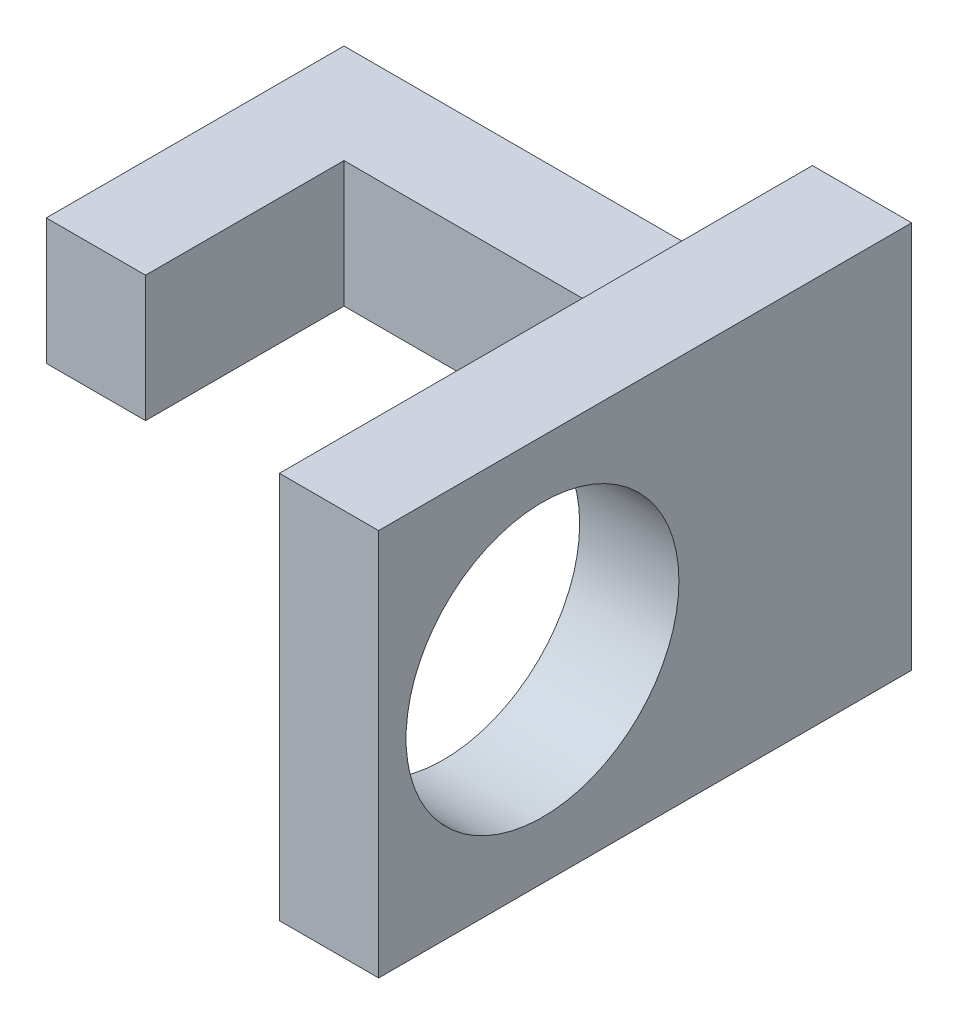
ISO-10303-21;
HEADER;
FILE_DESCRIPTION(('STEP AP214'),'2;1');
FILE_NAME('part.step','',(''),(''),'','','');
FILE_SCHEMA(('AUTOMOTIVE_DESIGN { 1 0 10303 214 1 1 1 1 }'));
ENDSEC;
DATA;
#1=APPLICATION_CONTEXT('core data for automotive mechanical design processes');
#2=APPLICATION_PROTOCOL_DEFINITION('international standard','automotive_design',2000,#1);
#3=PRODUCT_CONTEXT('',#1,'mechanical');
#4=PRODUCT('Part','Part','',(#3));
#5=PRODUCT_RELATED_PRODUCT_CATEGORY('part','',(#4));
#6=PRODUCT_DEFINITION_FORMATION('','',#4);
#7=PRODUCT_DEFINITION_CONTEXT('part definition',#1,'design');
#8=PRODUCT_DEFINITION('design','',#6,#7);
#9=PRODUCT_DEFINITION_SHAPE('','',#8);
#10=(LENGTH_UNIT() NAMED_UNIT(*) SI_UNIT(.MILLI.,.METRE.));
#11=(NAMED_UNIT(*) PLANE_ANGLE_UNIT() SI_UNIT($,.RADIAN.));
#12=(NAMED_UNIT(*) SI_UNIT($,.STERADIAN.) SOLID_ANGLE_UNIT());
#13=UNCERTAINTY_MEASURE_WITH_UNIT(LENGTH_MEASURE(1.E-05),#10,'distance_accuracy_value','');
#14=(GEOMETRIC_REPRESENTATION_CONTEXT(3) GLOBAL_UNCERTAINTY_ASSIGNED_CONTEXT((#13)) GLOBAL_UNIT_ASSIGNED_CONTEXT((#10,
#11,#12)) REPRESENTATION_CONTEXT('',''));
#15=CARTESIAN_POINT('',(0.,0.,0.));
#16=DIRECTION('',(0.,0.,1.));
#17=DIRECTION('',(1.,0.,0.));
#18=AXIS2_PLACEMENT_3D('',#15,#16,#17);
#19=CARTESIAN_POINT('',(-22.2639438223955,2.54,-2.85612972190999));
#20=DIRECTION('',(-1.,0.,0.));
#21=DIRECTION('',(0.,0.,1.));
#22=AXIS2_PLACEMENT_3D('',#19,#20,#21);
#23=PLANE('',#22);
#24=DIRECTION('',(0.,0.,-1.));
#25=VECTOR('',#24,1.);
#26=CARTESIAN_POINT('',(-22.2639438223955,0.,-2.85612972190999));
#27=LINE('',#26,#25);
#28=CARTESIAN_POINT('',(-22.2639438223955,0.,1.14387027809001));
#29=VERTEX_POINT('',#28);
#30=CARTESIAN_POINT('',(-22.2639438223955,0.,-2.85612972190999));
#31=VERTEX_POINT('',#30);
#32=EDGE_CURVE('E117',#29,#31,#27,.T.);
#33=ORIENTED_EDGE('',*,*,#32,.T.);
#34=DIRECTION('',(0.,-1.,0.));
#35=VECTOR('',#34,1.);
#36=CARTESIAN_POINT('',(-22.2639438223955,2.54,-2.85612972190999));
#37=LINE('',#36,#35);
#38=CARTESIAN_POINT('',(-22.2639438223955,2.54,-2.85612972190999));
#39=VERTEX_POINT('',#38);
#40=EDGE_CURVE('E12',#39,#31,#37,.T.);
#41=ORIENTED_EDGE('',*,*,#40,.F.);
#42=DIRECTION('',(0.,0.,-1.));
#43=VECTOR('',#42,1.);
#44=CARTESIAN_POINT('',(-22.2639438223955,2.54,-2.85612972190999));
#45=LINE('',#44,#43);
#46=CARTESIAN_POINT('',(-22.2639438223955,2.54,1.14387027809001));
#47=VERTEX_POINT('',#46);
#48=EDGE_CURVE('E130',#47,#39,#45,.T.);
#49=ORIENTED_EDGE('',*,*,#48,.F.);
#50=DIRECTION('',(0.,-1.,0.));
#51=VECTOR('',#50,1.);
#52=CARTESIAN_POINT('',(-22.2639438223955,2.54,1.14387027809001));
#53=LINE('',#52,#51);
#54=EDGE_CURVE('E113',#47,#29,#53,.T.);
#55=ORIENTED_EDGE('',*,*,#54,.T.);
#56=EDGE_LOOP('',(#33,#41,#49,#55));
#57=FACE_BOUND('',#56,.T.);
#58=ADVANCED_FACE('F34',(#57),#23,.F.);
#59=CARTESIAN_POINT('',(-22.2639438223955,2.54,-2.85612972190999));
#60=DIRECTION('',(0.,0.,-1.));
#61=DIRECTION('',(-1.,0.,0.));
#62=AXIS2_PLACEMENT_3D('',#59,#60,#61);
#63=PLANE('',#62);
#64=DIRECTION('',(1.,0.,0.));
#65=VECTOR('',#64,1.);
#66=CARTESIAN_POINT('',(-22.2639438223955,0.,-2.85612972190999));
#67=LINE('',#66,#65);
#68=CARTESIAN_POINT('',(-14.8217438223955,0.,-2.85612972190999));
#69=VERTEX_POINT('',#68);
#70=EDGE_CURVE('E120',#31,#69,#67,.T.);
#71=ORIENTED_EDGE('',*,*,#70,.T.);
#72=DIRECTION('',(0.,-1.,0.));
#73=VECTOR('',#72,1.);
#74=CARTESIAN_POINT('',(-14.8217438223955,2.54,-2.85612972190999));
#75=LINE('',#74,#73);
#76=CARTESIAN_POINT('',(-14.8217438223955,2.54,-2.85612972190999));
#77=VERTEX_POINT('',#76);
#78=EDGE_CURVE('E42',#77,#69,#75,.T.);
#79=ORIENTED_EDGE('',*,*,#78,.F.);
#80=DIRECTION('',(1.,0.,0.));
#81=VECTOR('',#80,1.);
#82=CARTESIAN_POINT('',(-22.2639438223955,2.54,-2.85612972190999));
#83=LINE('',#82,#81);
#84=EDGE_CURVE('E85',#39,#77,#83,.T.);
#85=ORIENTED_EDGE('',*,*,#84,.F.);
#86=ORIENTED_EDGE('',*,*,#40,.T.);
#87=EDGE_LOOP('',(#71,#79,#85,#86));
#88=FACE_BOUND('',#87,.T.);
#89=ADVANCED_FACE('F139',(#88),#63,.F.);
#90=CARTESIAN_POINT('',(-24.2639438223955,2.54,-4.85612972190999));
#91=DIRECTION('',(0.,0.,1.));
#92=DIRECTION('',(1.,0.,0.));
#93=AXIS2_PLACEMENT_3D('',#90,#91,#92);
#94=PLANE('',#93);
#95=DIRECTION('',(-1.,0.,0.));
#96=VECTOR('',#95,1.);
#97=CARTESIAN_POINT('',(-24.2639438223955,0.,-4.85612972190999));
#98=LINE('',#97,#96);
#99=CARTESIAN_POINT('',(-14.8217438223955,0.,-4.85612972190999));
#100=VERTEX_POINT('',#99);
#101=CARTESIAN_POINT('',(-24.2639438223955,0.,-4.85612972190999));
#102=VERTEX_POINT('',#101);
#103=EDGE_CURVE('E108',#100,#102,#98,.T.);
#104=ORIENTED_EDGE('',*,*,#103,.T.);
#105=DIRECTION('',(0.,-1.,0.));
#106=VECTOR('',#105,1.);
#107=CARTESIAN_POINT('',(-24.2639438223955,2.54,-4.85612972190999));
#108=LINE('',#107,#106);
#109=CARTESIAN_POINT('',(-24.2639438223955,2.54,-4.85612972190999));
#110=VERTEX_POINT('',#109);
#111=EDGE_CURVE('E105',#110,#102,#108,.T.);
#112=ORIENTED_EDGE('',*,*,#111,.F.);
#113=DIRECTION('',(-1.,0.,0.));
#114=VECTOR('',#113,1.);
#115=CARTESIAN_POINT('',(-24.2639438223955,2.54,-4.85612972190999));
#116=LINE('',#115,#114);
#117=CARTESIAN_POINT('',(-14.8217438223955,2.54,-4.85612972190999));
#118=VERTEX_POINT('',#117);
#119=EDGE_CURVE('E94',#118,#110,#116,.T.);
#120=ORIENTED_EDGE('',*,*,#119,.F.);
#121=DIRECTION('',(0.,-1.,0.));
#122=VECTOR('',#121,1.);
#123=CARTESIAN_POINT('',(-14.8217438223955,5.17470008914699,-4.85612972190999));
#124=LINE('',#123,#122);
#125=CARTESIAN_POINT('',(-14.8217438223955,5.17470008914699,-4.85612972190999));
#126=VERTEX_POINT('',#125);
#127=EDGE_CURVE('E299',#126,#118,#124,.T.);
#128=ORIENTED_EDGE('',*,*,#127,.F.);
#129=DIRECTION('',(1.,0.,0.));
#130=VECTOR('',#129,1.);
#131=CARTESIAN_POINT('',(-14.8217438223955,5.17470008914699,-4.85612972190999));
#132=LINE('',#131,#130);
#133=CARTESIAN_POINT('',(-12.8217438223955,5.17470008914699,-4.85612972190999));
#134=VERTEX_POINT('',#133);
#135=EDGE_CURVE('E292',#126,#134,#132,.T.);
#136=ORIENTED_EDGE('',*,*,#135,.T.);
#137=DIRECTION('',(0.,-1.,0.));
#138=VECTOR('',#137,1.);
#139=CARTESIAN_POINT('',(-12.8217438223955,5.17470008914699,-4.85612972190999));
#140=LINE('',#139,#138);
#141=CARTESIAN_POINT('',(-12.8217438223955,-2.63470008914699,-4.85612972190999));
#142=VERTEX_POINT('',#141);
#143=EDGE_CURVE('E296',#134,#142,#140,.T.);
#144=ORIENTED_EDGE('',*,*,#143,.T.);
#145=DIRECTION('',(1.,0.,0.));
#146=VECTOR('',#145,1.);
#147=CARTESIAN_POINT('',(-14.8217438223955,-2.63470008914699,-4.85612972190999));
#148=LINE('',#147,#146);
#149=CARTESIAN_POINT('',(-14.8217438223955,-2.63470008914699,-4.85612972190999));
#150=VERTEX_POINT('',#149);
#151=EDGE_CURVE('E316',#150,#142,#148,.T.);
#152=ORIENTED_EDGE('',*,*,#151,.F.);
#153=EDGE_CURVE('E295',#100,#150,#124,.T.);
#154=ORIENTED_EDGE('',*,*,#153,.F.);
#155=EDGE_LOOP('',(#104,#112,#120,#128,#136,#144,#152,#154));
#156=FACE_BOUND('',#155,.T.);
#157=ADVANCED_FACE('F106',(#156),#94,.F.);
#158=CARTESIAN_POINT('',(-24.2639438223955,2.54,-4.85612972190999));
#159=DIRECTION('',(1.,0.,0.));
#160=DIRECTION('',(0.,0.,-1.));
#161=AXIS2_PLACEMENT_3D('',#158,#159,#160);
#162=PLANE('',#161);
#163=DIRECTION('',(0.,0.,1.));
#164=VECTOR('',#163,1.);
#165=CARTESIAN_POINT('',(-24.2639438223955,0.,-4.85612972190999));
#166=LINE('',#165,#164);
#167=CARTESIAN_POINT('',(-24.2639438223955,0.,1.14387027809001));
#168=VERTEX_POINT('',#167);
#169=EDGE_CURVE('E71',#102,#168,#166,.T.);
#170=ORIENTED_EDGE('',*,*,#169,.T.);
#171=DIRECTION('',(0.,-1.,0.));
#172=VECTOR('',#171,1.);
#173=CARTESIAN_POINT('',(-24.2639438223955,2.54,1.14387027809001));
#174=LINE('',#173,#172);
#175=CARTESIAN_POINT('',(-24.2639438223955,2.54,1.14387027809001));
#176=VERTEX_POINT('',#175);
#177=EDGE_CURVE('E109',#176,#168,#174,.T.);
#178=ORIENTED_EDGE('',*,*,#177,.F.);
#179=DIRECTION('',(0.,0.,1.));
#180=VECTOR('',#179,1.);
#181=CARTESIAN_POINT('',(-24.2639438223955,2.54,-4.85612972190999));
#182=LINE('',#181,#180);
#183=EDGE_CURVE('E98',#110,#176,#182,.T.);
#184=ORIENTED_EDGE('',*,*,#183,.F.);
#185=ORIENTED_EDGE('',*,*,#111,.T.);
#186=EDGE_LOOP('',(#170,#178,#184,#185));
#187=FACE_BOUND('',#186,.T.);
#188=ADVANCED_FACE('F111',(#187),#162,.F.);
#189=CARTESIAN_POINT('',(-24.2639438223955,2.54,1.14387027809001));
#190=DIRECTION('',(0.,0.,-1.));
#191=DIRECTION('',(-1.,0.,0.));
#192=AXIS2_PLACEMENT_3D('',#189,#190,#191);
#193=PLANE('',#192);
#194=DIRECTION('',(1.,0.,0.));
#195=VECTOR('',#194,1.);
#196=CARTESIAN_POINT('',(-24.2639438223955,0.,1.14387027809001));
#197=LINE('',#196,#195);
#198=EDGE_CURVE('E77',#168,#29,#197,.T.);
#199=ORIENTED_EDGE('',*,*,#198,.T.);
#200=ORIENTED_EDGE('',*,*,#54,.F.);
#201=DIRECTION('',(1.,0.,0.));
#202=VECTOR('',#201,1.);
#203=CARTESIAN_POINT('',(-24.2639438223955,2.54,1.14387027809001));
#204=LINE('',#203,#202);
#205=EDGE_CURVE('E50',#176,#47,#204,.T.);
#206=ORIENTED_EDGE('',*,*,#205,.F.);
#207=ORIENTED_EDGE('',*,*,#177,.T.);
#208=EDGE_LOOP('',(#199,#200,#206,#207));
#209=FACE_BOUND('',#208,.T.);
#210=ADVANCED_FACE('F146',(#209),#193,.F.);
#211=CARTESIAN_POINT('',(0.,2.54,0.));
#212=DIRECTION('',(0.,1.,0.));
#213=DIRECTION('',(0.,0.,1.));
#214=AXIS2_PLACEMENT_3D('',#211,#212,#213);
#215=PLANE('',#214);
#216=ORIENTED_EDGE('',*,*,#48,.T.);
#217=ORIENTED_EDGE('',*,*,#84,.T.);
#218=DIRECTION('',(0.,0.,-1.));
#219=VECTOR('',#218,1.);
#220=CARTESIAN_POINT('',(-14.8217438223955,2.54,-2.85612972190999));
#221=LINE('',#220,#219);
#222=EDGE_CURVE('E100',#77,#118,#221,.T.);
#223=ORIENTED_EDGE('',*,*,#222,.T.);
#224=ORIENTED_EDGE('',*,*,#119,.T.);
#225=ORIENTED_EDGE('',*,*,#183,.T.);
#226=ORIENTED_EDGE('',*,*,#205,.T.);
#227=EDGE_LOOP('',(#216,#217,#223,#224,#225,#226));
#228=FACE_BOUND('',#227,.T.);
#229=ADVANCED_FACE('F96',(#228),#215,.T.);
#230=CARTESIAN_POINT('',(0.,0.,0.));
#231=DIRECTION('',(0.,1.,0.));
#232=DIRECTION('',(0.,0.,1.));
#233=AXIS2_PLACEMENT_3D('',#230,#231,#232);
#234=PLANE('',#233);
#235=ORIENTED_EDGE('',*,*,#32,.F.);
#236=ORIENTED_EDGE('',*,*,#198,.F.);
#237=ORIENTED_EDGE('',*,*,#169,.F.);
#238=ORIENTED_EDGE('',*,*,#103,.F.);
#239=DIRECTION('',(0.,0.,-1.));
#240=VECTOR('',#239,1.);
#241=CARTESIAN_POINT('',(-14.8217438223955,0.,-2.85612972190999));
#242=LINE('',#241,#240);
#243=EDGE_CURVE('E124',#69,#100,#242,.T.);
#244=ORIENTED_EDGE('',*,*,#243,.F.);
#245=ORIENTED_EDGE('',*,*,#70,.F.);
#246=EDGE_LOOP('',(#235,#236,#237,#238,#244,#245));
#247=FACE_BOUND('',#246,.T.);
#248=ADVANCED_FACE('F143',(#247),#234,.F.);
#249=CARTESIAN_POINT('',(-12.8217438223955,0.,0.));
#250=DIRECTION('',(-1.,0.,0.));
#251=DIRECTION('',(0.,0.,1.));
#252=AXIS2_PLACEMENT_3D('',#249,#250,#251);
#253=PLANE('',#252);
#254=CARTESIAN_POINT('',(-12.8217438223955,1.27,2.58563874063967));
#255=DIRECTION('',(1.,0.,0.));
#256=DIRECTION('',(0.,0.,-1.));
#257=AXIS2_PLACEMENT_3D('',#254,#255,#256);
#258=CIRCLE('',#257,2.75);
#259=CARTESIAN_POINT('',(-12.8217438223955,1.27,-0.164361259360333));
#260=VERTEX_POINT('',#259);
#261=EDGE_CURVE('E268',#260,#260,#258,.T.);
#262=ORIENTED_EDGE('',*,*,#261,.F.);
#263=EDGE_LOOP('',(#262));
#264=FACE_BOUND('',#263,.T.);
#265=DIRECTION('',(0.,1.,0.));
#266=VECTOR('',#265,1.);
#267=CARTESIAN_POINT('',(-12.8217438223955,5.17470008914699,5.88763874063967));
#268=LINE('',#267,#266);
#269=CARTESIAN_POINT('',(-12.8217438223955,-2.63470008914699,5.88763874063967));
#270=VERTEX_POINT('',#269);
#271=CARTESIAN_POINT('',(-12.8217438223955,5.17470008914699,5.88763874063967));
#272=VERTEX_POINT('',#271);
#273=EDGE_CURVE('E269',#270,#272,#268,.T.);
#274=ORIENTED_EDGE('',*,*,#273,.F.);
#275=DIRECTION('',(0.,0.,1.));
#276=VECTOR('',#275,1.);
#277=CARTESIAN_POINT('',(-12.8217438223955,-2.63470008914699,5.88763874063967));
#278=LINE('',#277,#276);
#279=EDGE_CURVE('E279',#142,#270,#278,.T.);
#280=ORIENTED_EDGE('',*,*,#279,.F.);
#281=ORIENTED_EDGE('',*,*,#143,.F.);
#282=DIRECTION('',(0.,0.,-1.));
#283=VECTOR('',#282,1.);
#284=CARTESIAN_POINT('',(-12.8217438223955,5.17470008914699,5.88763874063967));
#285=LINE('',#284,#283);
#286=EDGE_CURVE('E289',#272,#134,#285,.T.);
#287=ORIENTED_EDGE('',*,*,#286,.F.);
#288=EDGE_LOOP('',(#274,#280,#281,#287));
#289=FACE_BOUND('',#288,.T.);
#290=ADVANCED_FACE('F198',(#264,#289),#253,.F.);
#291=CARTESIAN_POINT('',(-14.8217438223955,0.,0.));
#292=DIRECTION('',(-1.,0.,0.));
#293=DIRECTION('',(0.,0.,1.));
#294=AXIS2_PLACEMENT_3D('',#291,#292,#293);
#295=PLANE('',#294);
#296=ORIENTED_EDGE('',*,*,#78,.T.);
#297=ORIENTED_EDGE('',*,*,#243,.T.);
#298=ORIENTED_EDGE('',*,*,#153,.T.);
#299=DIRECTION('',(0.,0.,1.));
#300=VECTOR('',#299,1.);
#301=CARTESIAN_POINT('',(-14.8217438223955,-2.63470008914699,5.88763874063967));
#302=LINE('',#301,#300);
#303=CARTESIAN_POINT('',(-14.8217438223955,-2.63470008914699,5.88763874063967));
#304=VERTEX_POINT('',#303);
#305=EDGE_CURVE('E319',#150,#304,#302,.T.);
#306=ORIENTED_EDGE('',*,*,#305,.T.);
#307=DIRECTION('',(0.,1.,0.));
#308=VECTOR('',#307,1.);
#309=CARTESIAN_POINT('',(-14.8217438223955,5.17470008914699,5.88763874063967));
#310=LINE('',#309,#308);
#311=CARTESIAN_POINT('',(-14.8217438223955,5.17470008914699,5.88763874063967));
#312=VERTEX_POINT('',#311);
#313=EDGE_CURVE('E280',#304,#312,#310,.T.);
#314=ORIENTED_EDGE('',*,*,#313,.T.);
#315=DIRECTION('',(0.,0.,-1.));
#316=VECTOR('',#315,1.);
#317=CARTESIAN_POINT('',(-14.8217438223955,5.17470008914699,5.88763874063967));
#318=LINE('',#317,#316);
#319=EDGE_CURVE('E121',#312,#126,#318,.T.);
#320=ORIENTED_EDGE('',*,*,#319,.T.);
#321=ORIENTED_EDGE('',*,*,#127,.T.);
#322=ORIENTED_EDGE('',*,*,#222,.F.);
#323=EDGE_LOOP('',(#296,#297,#298,#306,#314,#320,#321,#322));
#324=FACE_BOUND('',#323,.T.);
#325=CARTESIAN_POINT('',(-14.8217438223955,1.27,2.58563874063967));
#326=DIRECTION('',(1.,0.,0.));
#327=DIRECTION('',(0.,0.,-1.));
#328=AXIS2_PLACEMENT_3D('',#325,#326,#327);
#329=CIRCLE('',#328,2.75);
#330=CARTESIAN_POINT('',(-14.8217438223955,1.27,-0.164361259360333));
#331=VERTEX_POINT('',#330);
#332=EDGE_CURVE('E265',#331,#331,#329,.T.);
#333=ORIENTED_EDGE('',*,*,#332,.T.);
#334=EDGE_LOOP('',(#333));
#335=FACE_BOUND('',#334,.T.);
#336=ADVANCED_FACE('F134',(#324,#335),#295,.T.);
#337=CARTESIAN_POINT('',(-14.8217438223955,5.17470008914699,5.88763874063967));
#338=DIRECTION('',(0.,0.,-1.));
#339=DIRECTION('',(-1.,0.,0.));
#340=AXIS2_PLACEMENT_3D('',#337,#338,#339);
#341=PLANE('',#340);
#342=ORIENTED_EDGE('',*,*,#273,.T.);
#343=DIRECTION('',(1.,0.,0.));
#344=VECTOR('',#343,1.);
#345=CARTESIAN_POINT('',(-14.8217438223955,5.17470008914699,5.88763874063967));
#346=LINE('',#345,#344);
#347=EDGE_CURVE('E276',#312,#272,#346,.T.);
#348=ORIENTED_EDGE('',*,*,#347,.F.);
#349=ORIENTED_EDGE('',*,*,#313,.F.);
#350=DIRECTION('',(1.,0.,0.));
#351=VECTOR('',#350,1.);
#352=CARTESIAN_POINT('',(-14.8217438223955,-2.63470008914699,5.88763874063967));
#353=LINE('',#352,#351);
#354=EDGE_CURVE('E272',#304,#270,#353,.T.);
#355=ORIENTED_EDGE('',*,*,#354,.T.);
#356=EDGE_LOOP('',(#342,#348,#349,#355));
#357=FACE_BOUND('',#356,.T.);
#358=ADVANCED_FACE('F213',(#357),#341,.F.);
#359=CARTESIAN_POINT('',(-14.8217438223955,-2.63470008914699,5.88763874063967));
#360=DIRECTION('',(0.,1.,0.));
#361=DIRECTION('',(0.,0.,1.));
#362=AXIS2_PLACEMENT_3D('',#359,#360,#361);
#363=PLANE('',#362);
#364=ORIENTED_EDGE('',*,*,#279,.T.);
#365=ORIENTED_EDGE('',*,*,#354,.F.);
#366=ORIENTED_EDGE('',*,*,#305,.F.);
#367=ORIENTED_EDGE('',*,*,#151,.T.);
#368=EDGE_LOOP('',(#364,#365,#366,#367));
#369=FACE_BOUND('',#368,.T.);
#370=ADVANCED_FACE('F221',(#369),#363,.F.);
#371=CARTESIAN_POINT('',(-14.8217438223955,5.17470008914699,5.88763874063967));
#372=DIRECTION('',(0.,-1.,0.));
#373=DIRECTION('',(0.,0.,-1.));
#374=AXIS2_PLACEMENT_3D('',#371,#372,#373);
#375=PLANE('',#374);
#376=ORIENTED_EDGE('',*,*,#286,.T.);
#377=ORIENTED_EDGE('',*,*,#135,.F.);
#378=ORIENTED_EDGE('',*,*,#319,.F.);
#379=ORIENTED_EDGE('',*,*,#347,.T.);
#380=EDGE_LOOP('',(#376,#377,#378,#379));
#381=FACE_BOUND('',#380,.T.);
#382=ADVANCED_FACE('F230',(#381),#375,.F.);
#383=CARTESIAN_POINT('',(-14.8217438223955,1.27,2.58563874063967));
#384=DIRECTION('',(1.,0.,0.));
#385=DIRECTION('',(0.,0.,-1.));
#386=AXIS2_PLACEMENT_3D('',#383,#384,#385);
#387=CYLINDRICAL_SURFACE('',#386,2.75);
#388=ORIENTED_EDGE('',*,*,#332,.F.);
#389=EDGE_LOOP('',(#388));
#390=FACE_BOUND('',#389,.T.);
#391=ORIENTED_EDGE('',*,*,#261,.T.);
#392=EDGE_LOOP('',(#391));
#393=FACE_BOUND('',#392,.T.);
#394=ADVANCED_FACE('F206',(#390,#393),#387,.F.);
#395=CLOSED_SHELL('',(#58,#89,#157,#188,#210,#229,#248,#290,#336,#358,#370,#382,#394));
#396=MANIFOLD_SOLID_BREP('B2',#395);
#397=ADVANCED_BREP_SHAPE_REPRESENTATION('',(#18,#396),#14);
#398=SHAPE_DEFINITION_REPRESENTATION(#9,#397);
ENDSEC;
END-ISO-10303-21;
